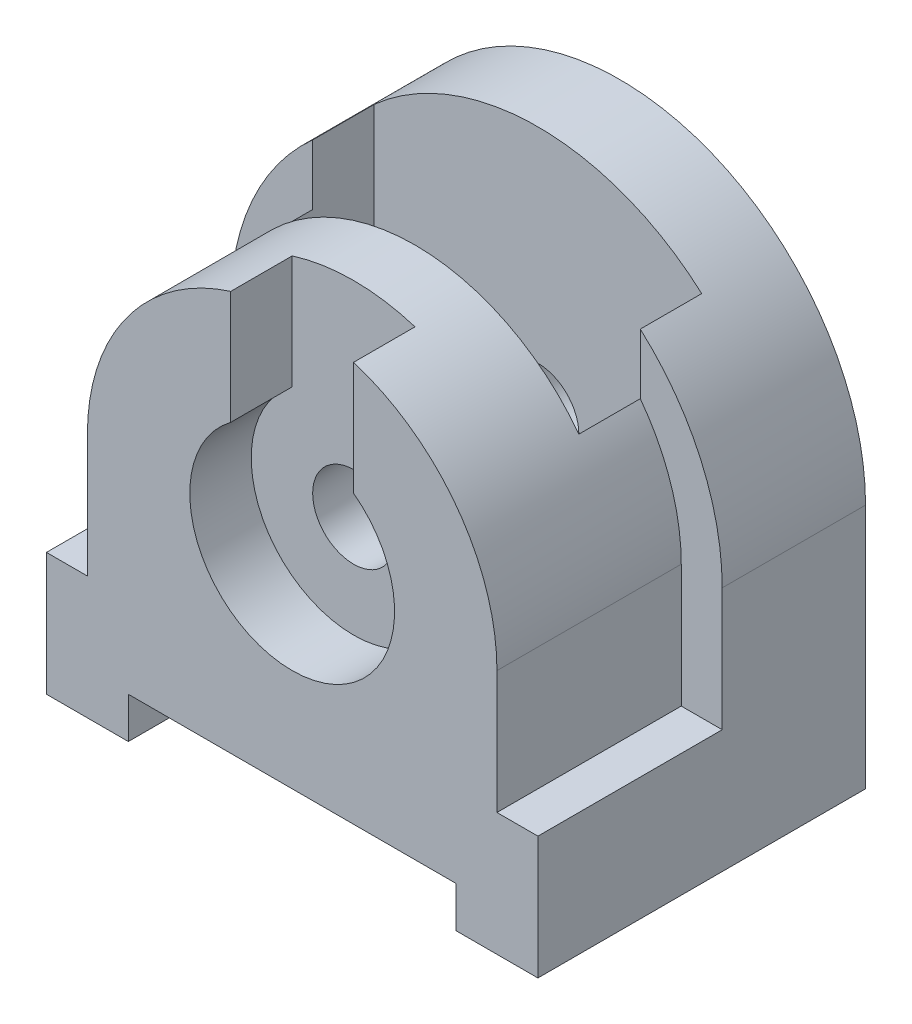
ISO-10303-21;
HEADER;
FILE_DESCRIPTION(('STEP AP214'),'2;1');
FILE_NAME('part.step','',(''),(''),'','','');
FILE_SCHEMA(('AUTOMOTIVE_DESIGN { 1 0 10303 214 1 1 1 1 }'));
ENDSEC;
DATA;
#1=APPLICATION_CONTEXT('core data for automotive mechanical design processes');
#2=APPLICATION_PROTOCOL_DEFINITION('international standard','automotive_design',2000,#1);
#3=PRODUCT_CONTEXT('',#1,'mechanical');
#4=PRODUCT('Part','Part','',(#3));
#5=PRODUCT_RELATED_PRODUCT_CATEGORY('part','',(#4));
#6=PRODUCT_DEFINITION_FORMATION('','',#4);
#7=PRODUCT_DEFINITION_CONTEXT('part definition',#1,'design');
#8=PRODUCT_DEFINITION('design','',#6,#7);
#9=PRODUCT_DEFINITION_SHAPE('','',#8);
#10=(LENGTH_UNIT() NAMED_UNIT(*) SI_UNIT(.MILLI.,.METRE.));
#11=(NAMED_UNIT(*) PLANE_ANGLE_UNIT() SI_UNIT($,.RADIAN.));
#12=(NAMED_UNIT(*) SI_UNIT($,.STERADIAN.) SOLID_ANGLE_UNIT());
#13=UNCERTAINTY_MEASURE_WITH_UNIT(LENGTH_MEASURE(1.E-05),#10,'distance_accuracy_value','');
#14=(GEOMETRIC_REPRESENTATION_CONTEXT(3) GLOBAL_UNCERTAINTY_ASSIGNED_CONTEXT((#13)) GLOBAL_UNIT_ASSIGNED_CONTEXT((#10,
#11,#12)) REPRESENTATION_CONTEXT('',''));
#15=CARTESIAN_POINT('',(0.,0.,0.));
#16=DIRECTION('',(0.,0.,1.));
#17=DIRECTION('',(1.,0.,0.));
#18=AXIS2_PLACEMENT_3D('',#15,#16,#17);
#19=CARTESIAN_POINT('',(100.,960.,20.));
#20=DIRECTION('',(0.,0.,-1.));
#21=DIRECTION('',(-1.,0.,0.));
#22=AXIS2_PLACEMENT_3D('',#19,#20,#21);
#23=PLANE('',#22);
#24=CARTESIAN_POINT('',(60.,60.,20.));
#25=DIRECTION('',(0.,0.,-1.));
#26=DIRECTION('',(-1.,0.,0.));
#27=AXIS2_PLACEMENT_3D('',#24,#25,#26);
#28=CIRCLE('',#27,9.99999999999999);
#29=CARTESIAN_POINT('',(50.,60.,20.));
#30=VERTEX_POINT('',#29);
#31=EDGE_CURVE('E37',#30,#30,#28,.F.);
#32=ORIENTED_EDGE('',*,*,#31,.F.);
#33=EDGE_LOOP('',(#32));
#34=FACE_BOUND('',#33,.T.);
#35=DIRECTION('',(0.,1.,0.));
#36=VECTOR('',#35,1.);
#37=CARTESIAN_POINT('',(65.,10.,20.));
#38=LINE('',#37,#36);
#39=CARTESIAN_POINT('',(65.,10.,20.));
#40=VERTEX_POINT('',#39);
#41=CARTESIAN_POINT('',(65.,35.,20.));
#42=VERTEX_POINT('',#41);
#43=EDGE_CURVE('E516',#40,#42,#38,.T.);
#44=ORIENTED_EDGE('',*,*,#43,.F.);
#45=DIRECTION('',(1.,0.,0.));
#46=VECTOR('',#45,1.);
#47=CARTESIAN_POINT('',(100.,10.,20.));
#48=LINE('',#47,#46);
#49=CARTESIAN_POINT('',(100.,10.,20.));
#50=VERTEX_POINT('',#49);
#51=EDGE_CURVE('E252',#40,#50,#48,.T.);
#52=ORIENTED_EDGE('',*,*,#51,.T.);
#53=DIRECTION('',(0.,-1.,0.));
#54=VECTOR('',#53,1.);
#55=CARTESIAN_POINT('',(100.,960.,20.));
#56=LINE('',#55,#54);
#57=CARTESIAN_POINT('',(100.,104.721359549996,20.));
#58=VERTEX_POINT('',#57);
#59=EDGE_CURVE('E256',#58,#50,#56,.T.);
#60=ORIENTED_EDGE('',*,*,#59,.F.);
#61=CARTESIAN_POINT('',(60.,60.,20.));
#62=DIRECTION('',(0.,0.,-1.));
#63=DIRECTION('',(-1.,0.,0.));
#64=AXIS2_PLACEMENT_3D('',#61,#62,#63);
#65=CIRCLE('',#64,60.);
#66=CARTESIAN_POINT('',(20.,104.721359549996,20.));
#67=VERTEX_POINT('',#66);
#68=EDGE_CURVE('E271',#58,#67,#65,.F.);
#69=ORIENTED_EDGE('',*,*,#68,.T.);
#70=DIRECTION('',(0.,-1.,0.));
#71=VECTOR('',#70,1.);
#72=CARTESIAN_POINT('',(20.,960.,20.));
#73=LINE('',#72,#71);
#74=CARTESIAN_POINT('',(20.,10.,20.));
#75=VERTEX_POINT('',#74);
#76=EDGE_CURVE('E260',#67,#75,#73,.T.);
#77=ORIENTED_EDGE('',*,*,#76,.T.);
#78=CARTESIAN_POINT('',(55.,10.,20.));
#79=VERTEX_POINT('',#78);
#80=EDGE_CURVE('E253',#75,#79,#48,.T.);
#81=ORIENTED_EDGE('',*,*,#80,.T.);
#82=DIRECTION('',(0.,-1.,0.));
#83=VECTOR('',#82,1.);
#84=CARTESIAN_POINT('',(55.,10.,20.));
#85=LINE('',#84,#83);
#86=CARTESIAN_POINT('',(55.,35.,20.));
#87=VERTEX_POINT('',#86);
#88=EDGE_CURVE('E55',#87,#79,#85,.T.);
#89=ORIENTED_EDGE('',*,*,#88,.F.);
#90=DIRECTION('',(-1.,0.,0.));
#91=VECTOR('',#90,1.);
#92=CARTESIAN_POINT('',(65.,35.,20.));
#93=LINE('',#92,#91);
#94=EDGE_CURVE('E50',#42,#87,#93,.T.);
#95=ORIENTED_EDGE('',*,*,#94,.F.);
#96=EDGE_LOOP('',(#44,#52,#60,#69,#77,#81,#89,#95));
#97=FACE_BOUND('',#96,.T.);
#98=ADVANCED_FACE('F33',(#34,#97),#23,.F.);
#99=CARTESIAN_POINT('',(100.,960.,50.));
#100=DIRECTION('',(0.,0.,1.));
#101=DIRECTION('',(1.,0.,0.));
#102=AXIS2_PLACEMENT_3D('',#99,#100,#101);
#103=PLANE('',#102);
#104=CARTESIAN_POINT('',(60.,60.,50.));
#105=DIRECTION('',(0.,0.,1.));
#106=DIRECTION('',(1.,0.,0.));
#107=AXIS2_PLACEMENT_3D('',#104,#105,#106);
#108=CIRCLE('',#107,9.99999999999999);
#109=CARTESIAN_POINT('',(70.,60.,50.));
#110=VERTEX_POINT('',#109);
#111=EDGE_CURVE('E268',#110,#110,#108,.F.);
#112=ORIENTED_EDGE('',*,*,#111,.F.);
#113=EDGE_LOOP('',(#112));
#114=FACE_BOUND('',#113,.T.);
#115=DIRECTION('',(0.,1.,0.));
#116=VECTOR('',#115,1.);
#117=CARTESIAN_POINT('',(65.,10.,50.));
#118=LINE('',#117,#116);
#119=CARTESIAN_POINT('',(65.,10.,50.));
#120=VERTEX_POINT('',#119);
#121=CARTESIAN_POINT('',(65.,35.,50.));
#122=VERTEX_POINT('',#121);
#123=EDGE_CURVE('E508',#120,#122,#118,.T.);
#124=ORIENTED_EDGE('',*,*,#123,.T.);
#125=DIRECTION('',(-1.,0.,0.));
#126=VECTOR('',#125,1.);
#127=CARTESIAN_POINT('',(65.,35.,50.));
#128=LINE('',#127,#126);
#129=CARTESIAN_POINT('',(55.,35.,50.));
#130=VERTEX_POINT('',#129);
#131=EDGE_CURVE('E237',#122,#130,#128,.T.);
#132=ORIENTED_EDGE('',*,*,#131,.T.);
#133=DIRECTION('',(0.,-1.,0.));
#134=VECTOR('',#133,1.);
#135=CARTESIAN_POINT('',(55.,10.,50.));
#136=LINE('',#135,#134);
#137=CARTESIAN_POINT('',(55.,10.,50.));
#138=VERTEX_POINT('',#137);
#139=EDGE_CURVE('E234',#130,#138,#136,.T.);
#140=ORIENTED_EDGE('',*,*,#139,.T.);
#141=DIRECTION('',(-1.,0.,0.));
#142=VECTOR('',#141,1.);
#143=CARTESIAN_POINT('',(100.,10.,50.));
#144=LINE('',#143,#142);
#145=CARTESIAN_POINT('',(20.,10.,50.));
#146=VERTEX_POINT('',#145);
#147=EDGE_CURVE('E219',#138,#146,#144,.T.);
#148=ORIENTED_EDGE('',*,*,#147,.T.);
#149=DIRECTION('',(0.,-1.,0.));
#150=VECTOR('',#149,1.);
#151=CARTESIAN_POINT('',(20.,960.,50.));
#152=LINE('',#151,#150);
#153=CARTESIAN_POINT('',(20.,90.0000000000002,50.));
#154=VERTEX_POINT('',#153);
#155=EDGE_CURVE('E262',#154,#146,#152,.T.);
#156=ORIENTED_EDGE('',*,*,#155,.F.);
#157=CARTESIAN_POINT('',(60.,60.,50.));
#158=DIRECTION('',(0.,0.,-1.));
#159=DIRECTION('',(1.,0.,0.));
#160=AXIS2_PLACEMENT_3D('',#157,#158,#159);
#161=CIRCLE('',#160,50.);
#162=CARTESIAN_POINT('',(100.,90.0000000000002,50.));
#163=VERTEX_POINT('',#162);
#164=EDGE_CURVE('E273',#154,#163,#161,.T.);
#165=ORIENTED_EDGE('',*,*,#164,.T.);
#166=DIRECTION('',(0.,-1.,0.));
#167=VECTOR('',#166,1.);
#168=CARTESIAN_POINT('',(100.,960.,50.));
#169=LINE('',#168,#167);
#170=CARTESIAN_POINT('',(100.,10.,50.));
#171=VERTEX_POINT('',#170);
#172=EDGE_CURVE('E255',#163,#171,#169,.T.);
#173=ORIENTED_EDGE('',*,*,#172,.T.);
#174=EDGE_CURVE('E230',#171,#120,#144,.T.);
#175=ORIENTED_EDGE('',*,*,#174,.T.);
#176=EDGE_LOOP('',(#124,#132,#140,#148,#156,#165,#173,#175));
#177=FACE_BOUND('',#176,.T.);
#178=ADVANCED_FACE('F235',(#114,#177),#103,.F.);
#179=CARTESIAN_POINT('',(60.,60.,0.));
#180=DIRECTION('',(0.,0.,1.));
#181=DIRECTION('',(1.,0.,0.));
#182=AXIS2_PLACEMENT_3D('',#179,#180,#181);
#183=CYLINDRICAL_SURFACE('',#182,9.99999999999999);
#184=ORIENTED_EDGE('',*,*,#31,.T.);
#185=EDGE_LOOP('',(#184));
#186=FACE_BOUND('',#185,.T.);
#187=CARTESIAN_POINT('',(60.,60.,0.));
#188=DIRECTION('',(0.,0.,1.));
#189=DIRECTION('',(1.,0.,0.));
#190=AXIS2_PLACEMENT_3D('',#187,#188,#189);
#191=CIRCLE('',#190,9.99999999999999);
#192=CARTESIAN_POINT('',(70.,60.,0.));
#193=VERTEX_POINT('',#192);
#194=EDGE_CURVE('E370',#193,#193,#191,.T.);
#195=ORIENTED_EDGE('',*,*,#194,.F.);
#196=EDGE_LOOP('',(#195));
#197=FACE_BOUND('',#196,.T.);
#198=ADVANCED_FACE('F448',(#186,#197),#183,.F.);
#199=CARTESIAN_POINT('',(60.,60.,0.));
#200=DIRECTION('',(0.,0.,1.));
#201=DIRECTION('',(1.,0.,0.));
#202=AXIS2_PLACEMENT_3D('',#199,#200,#201);
#203=CYLINDRICAL_SURFACE('',#202,60.);
#204=DIRECTION('',(0.,0.,1.));
#205=VECTOR('',#204,1.);
#206=CARTESIAN_POINT('',(100.,104.721359549996,0.));
#207=LINE('',#206,#205);
#208=CARTESIAN_POINT('',(100.,104.721359549996,35.));
#209=VERTEX_POINT('',#208);
#210=EDGE_CURVE('E266',#209,#58,#207,.F.);
#211=ORIENTED_EDGE('',*,*,#210,.F.);
#212=CARTESIAN_POINT('',(60.,60.,35.));
#213=DIRECTION('',(0.,0.,1.));
#214=DIRECTION('',(1.,0.,0.));
#215=AXIS2_PLACEMENT_3D('',#212,#213,#214);
#216=CIRCLE('',#215,60.);
#217=CARTESIAN_POINT('',(120.,60.,35.));
#218=VERTEX_POINT('',#217);
#219=EDGE_CURVE('E296',#218,#209,#216,.T.);
#220=ORIENTED_EDGE('',*,*,#219,.F.);
#221=DIRECTION('',(0.,0.,-1.));
#222=VECTOR('',#221,1.);
#223=CARTESIAN_POINT('',(120.,60.,80.));
#224=LINE('',#223,#222);
#225=CARTESIAN_POINT('',(120.,60.,0.));
#226=VERTEX_POINT('',#225);
#227=EDGE_CURVE('E425',#218,#226,#224,.T.);
#228=ORIENTED_EDGE('',*,*,#227,.T.);
#229=CARTESIAN_POINT('',(60.,60.,0.));
#230=DIRECTION('',(0.,0.,1.));
#231=DIRECTION('',(1.,0.,0.));
#232=AXIS2_PLACEMENT_3D('',#229,#230,#231);
#233=CIRCLE('',#232,60.);
#234=CARTESIAN_POINT('',(0.,60.,0.));
#235=VERTEX_POINT('',#234);
#236=EDGE_CURVE('E373',#226,#235,#233,.T.);
#237=ORIENTED_EDGE('',*,*,#236,.T.);
#238=DIRECTION('',(0.,0.,-1.));
#239=VECTOR('',#238,1.);
#240=CARTESIAN_POINT('',(0.,60.,80.));
#241=LINE('',#240,#239);
#242=CARTESIAN_POINT('',(0.,60.,35.));
#243=VERTEX_POINT('',#242);
#244=EDGE_CURVE('E415',#243,#235,#241,.T.);
#245=ORIENTED_EDGE('',*,*,#244,.F.);
#246=CARTESIAN_POINT('',(60.,60.,35.));
#247=DIRECTION('',(0.,0.,1.));
#248=DIRECTION('',(1.,0.,0.));
#249=AXIS2_PLACEMENT_3D('',#246,#247,#248);
#250=CIRCLE('',#249,60.);
#251=CARTESIAN_POINT('',(20.,104.721359549996,35.));
#252=VERTEX_POINT('',#251);
#253=EDGE_CURVE('E324',#252,#243,#250,.T.);
#254=ORIENTED_EDGE('',*,*,#253,.F.);
#255=DIRECTION('',(0.,0.,1.));
#256=VECTOR('',#255,1.);
#257=CARTESIAN_POINT('',(20.,104.721359549996,0.));
#258=LINE('',#257,#256);
#259=EDGE_CURVE('E259',#67,#252,#258,.T.);
#260=ORIENTED_EDGE('',*,*,#259,.F.);
#261=ORIENTED_EDGE('',*,*,#68,.F.);
#262=EDGE_LOOP('',(#211,#220,#228,#237,#245,#254,#260,#261));
#263=FACE_BOUND('',#262,.T.);
#264=ADVANCED_FACE('F548',(#263),#203,.T.);
#265=CARTESIAN_POINT('',(0.,0.,80.));
#266=DIRECTION('',(1.,0.,0.));
#267=DIRECTION('',(0.,0.,-1.));
#268=AXIS2_PLACEMENT_3D('',#265,#266,#267);
#269=PLANE('',#268);
#270=DIRECTION('',(0.,0.,1.));
#271=VECTOR('',#270,1.);
#272=CARTESIAN_POINT('',(0.,30.,35.));
#273=LINE('',#272,#271);
#274=CARTESIAN_POINT('',(0.,30.,35.));
#275=VERTEX_POINT('',#274);
#276=CARTESIAN_POINT('',(0.,30.,80.));
#277=VERTEX_POINT('',#276);
#278=EDGE_CURVE('E346',#275,#277,#273,.T.);
#279=ORIENTED_EDGE('',*,*,#278,.F.);
#280=DIRECTION('',(0.,-1.,0.));
#281=VECTOR('',#280,1.);
#282=CARTESIAN_POINT('',(0.,0.,35.));
#283=LINE('',#282,#281);
#284=EDGE_CURVE('E326',#243,#275,#283,.T.);
#285=ORIENTED_EDGE('',*,*,#284,.F.);
#286=ORIENTED_EDGE('',*,*,#244,.T.);
#287=DIRECTION('',(0.,-1.,0.));
#288=VECTOR('',#287,1.);
#289=CARTESIAN_POINT('',(0.,0.,0.));
#290=LINE('',#289,#288);
#291=CARTESIAN_POINT('',(0.,0.,0.));
#292=VERTEX_POINT('',#291);
#293=EDGE_CURVE('E396',#235,#292,#290,.T.);
#294=ORIENTED_EDGE('',*,*,#293,.T.);
#295=DIRECTION('',(0.,0.,-1.));
#296=VECTOR('',#295,1.);
#297=CARTESIAN_POINT('',(0.,0.,80.));
#298=LINE('',#297,#296);
#299=CARTESIAN_POINT('',(0.,0.,80.));
#300=VERTEX_POINT('',#299);
#301=EDGE_CURVE('E11',#300,#292,#298,.T.);
#302=ORIENTED_EDGE('',*,*,#301,.F.);
#303=DIRECTION('',(0.,-1.,0.));
#304=VECTOR('',#303,1.);
#305=CARTESIAN_POINT('',(0.,0.,80.));
#306=LINE('',#305,#304);
#307=EDGE_CURVE('E405',#277,#300,#306,.T.);
#308=ORIENTED_EDGE('',*,*,#307,.F.);
#309=EDGE_LOOP('',(#279,#285,#286,#294,#302,#308));
#310=FACE_BOUND('',#309,.T.);
#311=ADVANCED_FACE('F35',(#310),#269,.F.);
#312=CARTESIAN_POINT('',(0.,0.,80.));
#313=DIRECTION('',(0.,0.,-1.));
#314=DIRECTION('',(-1.,0.,0.));
#315=AXIS2_PLACEMENT_3D('',#312,#313,#314);
#316=PLANE('',#315);
#317=CARTESIAN_POINT('',(60.,60.,80.));
#318=DIRECTION('',(0.,0.,1.));
#319=DIRECTION('',(1.,0.,0.));
#320=AXIS2_PLACEMENT_3D('',#317,#318,#319);
#321=CIRCLE('',#320,50.);
#322=CARTESIAN_POINT('',(110.,60.,80.));
#323=VERTEX_POINT('',#322);
#324=CARTESIAN_POINT('',(75.,107.696960070847,80.));
#325=VERTEX_POINT('',#324);
#326=EDGE_CURVE('E284',#323,#325,#321,.T.);
#327=ORIENTED_EDGE('',*,*,#326,.T.);
#328=DIRECTION('',(0.,1.,0.));
#329=VECTOR('',#328,1.);
#330=CARTESIAN_POINT('',(75.,80.,80.));
#331=LINE('',#330,#329);
#332=CARTESIAN_POINT('',(75.,80.,80.));
#333=VERTEX_POINT('',#332);
#334=EDGE_CURVE('E361',#333,#325,#331,.T.);
#335=ORIENTED_EDGE('',*,*,#334,.F.);
#336=CARTESIAN_POINT('',(60.,60.,80.));
#337=DIRECTION('',(0.,0.,1.));
#338=DIRECTION('',(-1.,0.,0.));
#339=AXIS2_PLACEMENT_3D('',#336,#337,#338);
#340=CIRCLE('',#339,25.);
#341=CARTESIAN_POINT('',(45.,80.,80.));
#342=VERTEX_POINT('',#341);
#343=EDGE_CURVE('E343',#342,#333,#340,.T.);
#344=ORIENTED_EDGE('',*,*,#343,.F.);
#345=DIRECTION('',(0.,-1.,0.));
#346=VECTOR('',#345,1.);
#347=CARTESIAN_POINT('',(45.,80.,80.));
#348=LINE('',#347,#346);
#349=CARTESIAN_POINT('',(45.,107.696960070847,80.));
#350=VERTEX_POINT('',#349);
#351=EDGE_CURVE('E353',#350,#342,#348,.T.);
#352=ORIENTED_EDGE('',*,*,#351,.F.);
#353=CARTESIAN_POINT('',(60.,60.,80.));
#354=DIRECTION('',(0.,0.,1.));
#355=DIRECTION('',(1.,0.,0.));
#356=AXIS2_PLACEMENT_3D('',#353,#354,#355);
#357=CIRCLE('',#356,50.);
#358=CARTESIAN_POINT('',(10.,60.,80.));
#359=VERTEX_POINT('',#358);
#360=EDGE_CURVE('E311',#350,#359,#357,.T.);
#361=ORIENTED_EDGE('',*,*,#360,.T.);
#362=DIRECTION('',(0.,-1.,0.));
#363=VECTOR('',#362,1.);
#364=CARTESIAN_POINT('',(10.,0.,80.));
#365=LINE('',#364,#363);
#366=CARTESIAN_POINT('',(10.,30.,80.));
#367=VERTEX_POINT('',#366);
#368=EDGE_CURVE('E322',#359,#367,#365,.T.);
#369=ORIENTED_EDGE('',*,*,#368,.T.);
#370=DIRECTION('',(-1.,0.,0.));
#371=VECTOR('',#370,1.);
#372=CARTESIAN_POINT('',(0.,30.,80.));
#373=LINE('',#372,#371);
#374=EDGE_CURVE('E336',#367,#277,#373,.T.);
#375=ORIENTED_EDGE('',*,*,#374,.T.);
#376=ORIENTED_EDGE('',*,*,#307,.T.);
#377=DIRECTION('',(1.,0.,0.));
#378=VECTOR('',#377,1.);
#379=CARTESIAN_POINT('',(0.,0.,80.));
#380=LINE('',#379,#378);
#381=CARTESIAN_POINT('',(20.,0.,80.));
#382=VERTEX_POINT('',#381);
#383=EDGE_CURVE('E409',#300,#382,#380,.T.);
#384=ORIENTED_EDGE('',*,*,#383,.T.);
#385=DIRECTION('',(0.,-1.,0.));
#386=VECTOR('',#385,1.);
#387=CARTESIAN_POINT('',(20.,0.,80.));
#388=LINE('',#387,#386);
#389=CARTESIAN_POINT('',(20.,10.,80.));
#390=VERTEX_POINT('',#389);
#391=EDGE_CURVE('E376',#390,#382,#388,.T.);
#392=ORIENTED_EDGE('',*,*,#391,.F.);
#393=DIRECTION('',(-1.,0.,0.));
#394=VECTOR('',#393,1.);
#395=CARTESIAN_POINT('',(20.,10.,80.));
#396=LINE('',#395,#394);
#397=CARTESIAN_POINT('',(100.,10.,80.));
#398=VERTEX_POINT('',#397);
#399=EDGE_CURVE('E381',#398,#390,#396,.T.);
#400=ORIENTED_EDGE('',*,*,#399,.F.);
#401=DIRECTION('',(0.,1.,0.));
#402=VECTOR('',#401,1.);
#403=CARTESIAN_POINT('',(100.,0.,80.));
#404=LINE('',#403,#402);
#405=CARTESIAN_POINT('',(100.,0.,80.));
#406=VERTEX_POINT('',#405);
#407=EDGE_CURVE('E389',#406,#398,#404,.T.);
#408=ORIENTED_EDGE('',*,*,#407,.F.);
#409=CARTESIAN_POINT('',(120.,0.,80.));
#410=VERTEX_POINT('',#409);
#411=EDGE_CURVE('E407',#406,#410,#380,.T.);
#412=ORIENTED_EDGE('',*,*,#411,.T.);
#413=DIRECTION('',(0.,1.,0.));
#414=VECTOR('',#413,1.);
#415=CARTESIAN_POINT('',(120.,0.,80.));
#416=LINE('',#415,#414);
#417=CARTESIAN_POINT('',(120.,30.,80.));
#418=VERTEX_POINT('',#417);
#419=EDGE_CURVE('E412',#410,#418,#416,.T.);
#420=ORIENTED_EDGE('',*,*,#419,.T.);
#421=DIRECTION('',(1.,0.,0.));
#422=VECTOR('',#421,1.);
#423=CARTESIAN_POINT('',(0.,30.,80.));
#424=LINE('',#423,#422);
#425=CARTESIAN_POINT('',(110.,30.,80.));
#426=VERTEX_POINT('',#425);
#427=EDGE_CURVE('E289',#426,#418,#424,.T.);
#428=ORIENTED_EDGE('',*,*,#427,.F.);
#429=DIRECTION('',(0.,-1.,0.));
#430=VECTOR('',#429,1.);
#431=CARTESIAN_POINT('',(110.,0.,80.));
#432=LINE('',#431,#430);
#433=EDGE_CURVE('E304',#323,#426,#432,.T.);
#434=ORIENTED_EDGE('',*,*,#433,.F.);
#435=EDGE_LOOP('',(#327,#335,#344,#352,#361,#369,#375,#376,#384,#392,#400,#408,#412,#420,#428,#434));
#436=FACE_BOUND('',#435,.T.);
#437=ADVANCED_FACE('F535',(#436),#316,.F.);
#438=CARTESIAN_POINT('',(0.,0.,80.));
#439=DIRECTION('',(0.,1.,0.));
#440=DIRECTION('',(0.,0.,1.));
#441=AXIS2_PLACEMENT_3D('',#438,#439,#440);
#442=PLANE('',#441);
#443=DIRECTION('',(1.,0.,0.));
#444=VECTOR('',#443,1.);
#445=CARTESIAN_POINT('',(0.,0.,0.));
#446=LINE('',#445,#444);
#447=CARTESIAN_POINT('',(20.,0.,0.));
#448=VERTEX_POINT('',#447);
#449=EDGE_CURVE('E419',#292,#448,#446,.T.);
#450=ORIENTED_EDGE('',*,*,#449,.T.);
#451=DIRECTION('',(0.,0.,1.));
#452=VECTOR('',#451,1.);
#453=CARTESIAN_POINT('',(20.,0.,0.));
#454=LINE('',#453,#452);
#455=EDGE_CURVE('E387',#448,#382,#454,.T.);
#456=ORIENTED_EDGE('',*,*,#455,.T.);
#457=ORIENTED_EDGE('',*,*,#383,.F.);
#458=ORIENTED_EDGE('',*,*,#301,.T.);
#459=EDGE_LOOP('',(#450,#456,#457,#458));
#460=FACE_BOUND('',#459,.T.);
#461=ADVANCED_FACE('F541',(#460),#442,.F.);
#462=ORIENTED_EDGE('',*,*,#411,.F.);
#463=DIRECTION('',(0.,0.,1.));
#464=VECTOR('',#463,1.);
#465=CARTESIAN_POINT('',(100.,0.,0.));
#466=LINE('',#465,#464);
#467=CARTESIAN_POINT('',(100.,0.,0.));
#468=VERTEX_POINT('',#467);
#469=EDGE_CURVE('E401',#468,#406,#466,.T.);
#470=ORIENTED_EDGE('',*,*,#469,.F.);
#471=CARTESIAN_POINT('',(120.,0.,0.));
#472=VERTEX_POINT('',#471);
#473=EDGE_CURVE('E418',#468,#472,#446,.T.);
#474=ORIENTED_EDGE('',*,*,#473,.T.);
#475=DIRECTION('',(0.,0.,-1.));
#476=VECTOR('',#475,1.);
#477=CARTESIAN_POINT('',(120.,0.,80.));
#478=LINE('',#477,#476);
#479=EDGE_CURVE('E42',#410,#472,#478,.T.);
#480=ORIENTED_EDGE('',*,*,#479,.F.);
#481=EDGE_LOOP('',(#462,#470,#474,#480));
#482=FACE_BOUND('',#481,.T.);
#483=ADVANCED_FACE('F531',(#482),#442,.F.);
#484=CARTESIAN_POINT('',(120.,0.,80.));
#485=DIRECTION('',(-1.,0.,0.));
#486=DIRECTION('',(0.,0.,1.));
#487=AXIS2_PLACEMENT_3D('',#484,#485,#486);
#488=PLANE('',#487);
#489=DIRECTION('',(0.,1.,0.));
#490=VECTOR('',#489,1.);
#491=CARTESIAN_POINT('',(120.,0.,35.));
#492=LINE('',#491,#490);
#493=CARTESIAN_POINT('',(120.,30.,35.));
#494=VERTEX_POINT('',#493);
#495=EDGE_CURVE('E294',#494,#218,#492,.T.);
#496=ORIENTED_EDGE('',*,*,#495,.F.);
#497=DIRECTION('',(0.,0.,1.));
#498=VECTOR('',#497,1.);
#499=CARTESIAN_POINT('',(120.,30.,35.));
#500=LINE('',#499,#498);
#501=EDGE_CURVE('E312',#494,#418,#500,.T.);
#502=ORIENTED_EDGE('',*,*,#501,.T.);
#503=ORIENTED_EDGE('',*,*,#419,.F.);
#504=ORIENTED_EDGE('',*,*,#479,.T.);
#505=DIRECTION('',(0.,1.,0.));
#506=VECTOR('',#505,1.);
#507=CARTESIAN_POINT('',(120.,0.,0.));
#508=LINE('',#507,#506);
#509=EDGE_CURVE('E408',#472,#226,#508,.T.);
#510=ORIENTED_EDGE('',*,*,#509,.T.);
#511=ORIENTED_EDGE('',*,*,#227,.F.);
#512=EDGE_LOOP('',(#496,#502,#503,#504,#510,#511));
#513=FACE_BOUND('',#512,.T.);
#514=ADVANCED_FACE('F554',(#513),#488,.F.);
#515=CARTESIAN_POINT('',(0.,0.,0.));
#516=DIRECTION('',(0.,0.,-1.));
#517=DIRECTION('',(-1.,0.,0.));
#518=AXIS2_PLACEMENT_3D('',#515,#516,#517);
#519=PLANE('',#518);
#520=ORIENTED_EDGE('',*,*,#194,.T.);
#521=EDGE_LOOP('',(#520));
#522=FACE_BOUND('',#521,.T.);
#523=DIRECTION('',(0.,-1.,0.));
#524=VECTOR('',#523,1.);
#525=CARTESIAN_POINT('',(20.,0.,0.));
#526=LINE('',#525,#524);
#527=CARTESIAN_POINT('',(20.,10.,0.));
#528=VERTEX_POINT('',#527);
#529=EDGE_CURVE('E377',#528,#448,#526,.T.);
#530=ORIENTED_EDGE('',*,*,#529,.T.);
#531=ORIENTED_EDGE('',*,*,#449,.F.);
#532=ORIENTED_EDGE('',*,*,#293,.F.);
#533=ORIENTED_EDGE('',*,*,#236,.F.);
#534=ORIENTED_EDGE('',*,*,#509,.F.);
#535=ORIENTED_EDGE('',*,*,#473,.F.);
#536=DIRECTION('',(0.,1.,0.));
#537=VECTOR('',#536,1.);
#538=CARTESIAN_POINT('',(100.,0.,0.));
#539=LINE('',#538,#537);
#540=CARTESIAN_POINT('',(100.,10.,0.));
#541=VERTEX_POINT('',#540);
#542=EDGE_CURVE('E380',#468,#541,#539,.T.);
#543=ORIENTED_EDGE('',*,*,#542,.T.);
#544=DIRECTION('',(-1.,0.,0.));
#545=VECTOR('',#544,1.);
#546=CARTESIAN_POINT('',(20.,10.,0.));
#547=LINE('',#546,#545);
#548=EDGE_CURVE('E384',#541,#528,#547,.T.);
#549=ORIENTED_EDGE('',*,*,#548,.T.);
#550=EDGE_LOOP('',(#530,#531,#532,#533,#534,#535,#543,#549));
#551=FACE_BOUND('',#550,.T.);
#552=ADVANCED_FACE('F525',(#522,#551),#519,.T.);
#553=CARTESIAN_POINT('',(20.,0.,0.));
#554=DIRECTION('',(-1.,0.,0.));
#555=DIRECTION('',(0.,0.,1.));
#556=AXIS2_PLACEMENT_3D('',#553,#554,#555);
#557=PLANE('',#556);
#558=ORIENTED_EDGE('',*,*,#391,.T.);
#559=ORIENTED_EDGE('',*,*,#455,.F.);
#560=ORIENTED_EDGE('',*,*,#529,.F.);
#561=DIRECTION('',(0.,0.,1.));
#562=VECTOR('',#561,1.);
#563=CARTESIAN_POINT('',(20.,10.,0.));
#564=LINE('',#563,#562);
#565=EDGE_CURVE('E393',#528,#75,#564,.T.);
#566=ORIENTED_EDGE('',*,*,#565,.T.);
#567=ORIENTED_EDGE('',*,*,#76,.F.);
#568=ORIENTED_EDGE('',*,*,#259,.T.);
#569=DIRECTION('',(0.,-1.,0.));
#570=VECTOR('',#569,1.);
#571=CARTESIAN_POINT('',(20.,0.,35.));
#572=LINE('',#571,#570);
#573=CARTESIAN_POINT('',(20.,90.,35.));
#574=VERTEX_POINT('',#573);
#575=EDGE_CURVE('E321',#252,#574,#572,.T.);
#576=ORIENTED_EDGE('',*,*,#575,.T.);
#577=DIRECTION('',(0.,0.,1.));
#578=VECTOR('',#577,1.);
#579=CARTESIAN_POINT('',(20.,90.,35.));
#580=LINE('',#579,#578);
#581=EDGE_CURVE('E333',#574,#154,#580,.T.);
#582=ORIENTED_EDGE('',*,*,#581,.T.);
#583=ORIENTED_EDGE('',*,*,#155,.T.);
#584=EDGE_CURVE('E226',#146,#390,#564,.T.);
#585=ORIENTED_EDGE('',*,*,#584,.T.);
#586=EDGE_LOOP('',(#558,#559,#560,#566,#567,#568,#576,#582,#583,#585));
#587=FACE_BOUND('',#586,.T.);
#588=ADVANCED_FACE('F539',(#587),#557,.F.);
#589=CARTESIAN_POINT('',(20.,10.,0.));
#590=DIRECTION('',(0.,1.,0.));
#591=DIRECTION('',(0.,0.,1.));
#592=AXIS2_PLACEMENT_3D('',#589,#590,#591);
#593=PLANE('',#592);
#594=ORIENTED_EDGE('',*,*,#584,.F.);
#595=ORIENTED_EDGE('',*,*,#147,.F.);
#596=DIRECTION('',(0.,0.,-1.));
#597=VECTOR('',#596,1.);
#598=CARTESIAN_POINT('',(55.,10.,50.));
#599=LINE('',#598,#597);
#600=EDGE_CURVE('E224',#138,#79,#599,.T.);
#601=ORIENTED_EDGE('',*,*,#600,.T.);
#602=ORIENTED_EDGE('',*,*,#80,.F.);
#603=ORIENTED_EDGE('',*,*,#565,.F.);
#604=ORIENTED_EDGE('',*,*,#548,.F.);
#605=DIRECTION('',(0.,0.,1.));
#606=VECTOR('',#605,1.);
#607=CARTESIAN_POINT('',(100.,10.,0.));
#608=LINE('',#607,#606);
#609=EDGE_CURVE('E397',#541,#50,#608,.T.);
#610=ORIENTED_EDGE('',*,*,#609,.T.);
#611=ORIENTED_EDGE('',*,*,#51,.F.);
#612=DIRECTION('',(0.,0.,-1.));
#613=VECTOR('',#612,1.);
#614=CARTESIAN_POINT('',(65.,10.,50.));
#615=LINE('',#614,#613);
#616=EDGE_CURVE('E241',#120,#40,#615,.T.);
#617=ORIENTED_EDGE('',*,*,#616,.F.);
#618=ORIENTED_EDGE('',*,*,#174,.F.);
#619=EDGE_CURVE('E400',#171,#398,#608,.T.);
#620=ORIENTED_EDGE('',*,*,#619,.T.);
#621=ORIENTED_EDGE('',*,*,#399,.T.);
#622=EDGE_LOOP('',(#594,#595,#601,#602,#603,#604,#610,#611,#617,#618,#620,#621));
#623=FACE_BOUND('',#622,.T.);
#624=ADVANCED_FACE('F221',(#623),#593,.F.);
#625=CARTESIAN_POINT('',(100.,0.,0.));
#626=DIRECTION('',(1.,0.,0.));
#627=DIRECTION('',(0.,0.,-1.));
#628=AXIS2_PLACEMENT_3D('',#625,#626,#627);
#629=PLANE('',#628);
#630=ORIENTED_EDGE('',*,*,#407,.T.);
#631=ORIENTED_EDGE('',*,*,#619,.F.);
#632=ORIENTED_EDGE('',*,*,#172,.F.);
#633=DIRECTION('',(0.,0.,1.));
#634=VECTOR('',#633,1.);
#635=CARTESIAN_POINT('',(100.,90.,35.));
#636=LINE('',#635,#634);
#637=CARTESIAN_POINT('',(100.,90.,35.));
#638=VERTEX_POINT('',#637);
#639=EDGE_CURVE('E308',#638,#163,#636,.T.);
#640=ORIENTED_EDGE('',*,*,#639,.F.);
#641=DIRECTION('',(0.,-1.,0.));
#642=VECTOR('',#641,1.);
#643=CARTESIAN_POINT('',(100.,0.,35.));
#644=LINE('',#643,#642);
#645=EDGE_CURVE('E299',#209,#638,#644,.T.);
#646=ORIENTED_EDGE('',*,*,#645,.F.);
#647=ORIENTED_EDGE('',*,*,#210,.T.);
#648=ORIENTED_EDGE('',*,*,#59,.T.);
#649=ORIENTED_EDGE('',*,*,#609,.F.);
#650=ORIENTED_EDGE('',*,*,#542,.F.);
#651=ORIENTED_EDGE('',*,*,#469,.T.);
#652=EDGE_LOOP('',(#630,#631,#632,#640,#646,#647,#648,#649,#650,#651));
#653=FACE_BOUND('',#652,.T.);
#654=ADVANCED_FACE('F445',(#653),#629,.F.);
#655=ORIENTED_EDGE('',*,*,#111,.T.);
#656=EDGE_LOOP('',(#655));
#657=FACE_BOUND('',#656,.T.);
#658=CARTESIAN_POINT('',(60.,60.,65.));
#659=DIRECTION('',(0.,0.,-1.));
#660=DIRECTION('',(-1.,0.,0.));
#661=AXIS2_PLACEMENT_3D('',#658,#659,#660);
#662=CIRCLE('',#661,9.99999999999999);
#663=CARTESIAN_POINT('',(50.,60.,65.));
#664=VERTEX_POINT('',#663);
#665=EDGE_CURVE('E368',#664,#664,#662,.F.);
#666=ORIENTED_EDGE('',*,*,#665,.T.);
#667=EDGE_LOOP('',(#666));
#668=FACE_BOUND('',#667,.T.);
#669=ADVANCED_FACE('F431',(#657,#668),#183,.F.);
#670=CARTESIAN_POINT('',(60.,60.,65.));
#671=DIRECTION('',(0.,0.,-1.));
#672=DIRECTION('',(-1.,0.,0.));
#673=AXIS2_PLACEMENT_3D('',#670,#671,#672);
#674=PLANE('',#673);
#675=DIRECTION('',(0.,1.,0.));
#676=VECTOR('',#675,1.);
#677=CARTESIAN_POINT('',(75.,80.,65.));
#678=LINE('',#677,#676);
#679=CARTESIAN_POINT('',(75.,80.,65.));
#680=VERTEX_POINT('',#679);
#681=CARTESIAN_POINT('',(75.,107.696960070847,65.));
#682=VERTEX_POINT('',#681);
#683=EDGE_CURVE('E352',#680,#682,#678,.T.);
#684=ORIENTED_EDGE('',*,*,#683,.T.);
#685=CARTESIAN_POINT('',(60.,60.,65.));
#686=DIRECTION('',(0.,0.,-1.));
#687=DIRECTION('',(-1.,0.,0.));
#688=AXIS2_PLACEMENT_3D('',#685,#686,#687);
#689=CIRCLE('',#688,50.);
#690=CARTESIAN_POINT('',(45.,107.696960070847,65.));
#691=VERTEX_POINT('',#690);
#692=EDGE_CURVE('E278',#682,#691,#689,.F.);
#693=ORIENTED_EDGE('',*,*,#692,.T.);
#694=DIRECTION('',(0.,-1.,0.));
#695=VECTOR('',#694,1.);
#696=CARTESIAN_POINT('',(45.,80.,65.));
#697=LINE('',#696,#695);
#698=CARTESIAN_POINT('',(45.,80.,65.));
#699=VERTEX_POINT('',#698);
#700=EDGE_CURVE('E356',#691,#699,#697,.T.);
#701=ORIENTED_EDGE('',*,*,#700,.T.);
#702=CARTESIAN_POINT('',(60.,60.,65.));
#703=DIRECTION('',(0.,0.,1.));
#704=DIRECTION('',(-1.,0.,0.));
#705=AXIS2_PLACEMENT_3D('',#702,#703,#704);
#706=CIRCLE('',#705,25.);
#707=EDGE_CURVE('E349',#699,#680,#706,.T.);
#708=ORIENTED_EDGE('',*,*,#707,.T.);
#709=EDGE_LOOP('',(#684,#693,#701,#708));
#710=FACE_BOUND('',#709,.T.);
#711=ORIENTED_EDGE('',*,*,#665,.F.);
#712=EDGE_LOOP('',(#711));
#713=FACE_BOUND('',#712,.T.);
#714=ADVANCED_FACE('F433',(#710,#713),#674,.F.);
#715=CARTESIAN_POINT('',(60.,60.,65.));
#716=DIRECTION('',(0.,0.,1.));
#717=DIRECTION('',(1.,0.,0.));
#718=AXIS2_PLACEMENT_3D('',#715,#716,#717);
#719=CYLINDRICAL_SURFACE('',#718,25.);
#720=ORIENTED_EDGE('',*,*,#343,.T.);
#721=DIRECTION('',(0.,0.,1.));
#722=VECTOR('',#721,1.);
#723=CARTESIAN_POINT('',(75.,80.,65.));
#724=LINE('',#723,#722);
#725=EDGE_CURVE('E358',#680,#333,#724,.T.);
#726=ORIENTED_EDGE('',*,*,#725,.F.);
#727=ORIENTED_EDGE('',*,*,#707,.F.);
#728=DIRECTION('',(0.,0.,1.));
#729=VECTOR('',#728,1.);
#730=CARTESIAN_POINT('',(45.,80.,65.));
#731=LINE('',#730,#729);
#732=EDGE_CURVE('E365',#699,#342,#731,.T.);
#733=ORIENTED_EDGE('',*,*,#732,.T.);
#734=EDGE_LOOP('',(#720,#726,#727,#733));
#735=FACE_BOUND('',#734,.T.);
#736=ADVANCED_FACE('F435',(#735),#719,.F.);
#737=CARTESIAN_POINT('',(45.,80.,65.));
#738=DIRECTION('',(-1.,0.,0.));
#739=DIRECTION('',(0.,0.,1.));
#740=AXIS2_PLACEMENT_3D('',#737,#738,#739);
#741=PLANE('',#740);
#742=ORIENTED_EDGE('',*,*,#700,.F.);
#743=DIRECTION('',(0.,0.,1.));
#744=VECTOR('',#743,1.);
#745=CARTESIAN_POINT('',(45.,107.696960070847,50.));
#746=LINE('',#745,#744);
#747=EDGE_CURVE('E281',#691,#350,#746,.T.);
#748=ORIENTED_EDGE('',*,*,#747,.T.);
#749=ORIENTED_EDGE('',*,*,#351,.T.);
#750=ORIENTED_EDGE('',*,*,#732,.F.);
#751=EDGE_LOOP('',(#742,#748,#749,#750));
#752=FACE_BOUND('',#751,.T.);
#753=ADVANCED_FACE('F442',(#752),#741,.F.);
#754=CARTESIAN_POINT('',(75.,80.,65.));
#755=DIRECTION('',(1.,0.,0.));
#756=DIRECTION('',(0.,0.,-1.));
#757=AXIS2_PLACEMENT_3D('',#754,#755,#756);
#758=PLANE('',#757);
#759=ORIENTED_EDGE('',*,*,#334,.T.);
#760=DIRECTION('',(0.,0.,1.));
#761=VECTOR('',#760,1.);
#762=CARTESIAN_POINT('',(75.,107.696960070847,50.));
#763=LINE('',#762,#761);
#764=EDGE_CURVE('E275',#325,#682,#763,.F.);
#765=ORIENTED_EDGE('',*,*,#764,.T.);
#766=ORIENTED_EDGE('',*,*,#683,.F.);
#767=ORIENTED_EDGE('',*,*,#725,.T.);
#768=EDGE_LOOP('',(#759,#765,#766,#767));
#769=FACE_BOUND('',#768,.T.);
#770=ADVANCED_FACE('F489',(#769),#758,.F.);
#771=CARTESIAN_POINT('',(60.,60.,35.));
#772=DIRECTION('',(0.,0.,1.));
#773=DIRECTION('',(1.,0.,0.));
#774=AXIS2_PLACEMENT_3D('',#771,#772,#773);
#775=CYLINDRICAL_SURFACE('',#774,50.);
#776=ORIENTED_EDGE('',*,*,#164,.F.);
#777=ORIENTED_EDGE('',*,*,#581,.F.);
#778=CARTESIAN_POINT('',(60.,60.,35.));
#779=DIRECTION('',(0.,0.,1.));
#780=DIRECTION('',(1.,0.,0.));
#781=AXIS2_PLACEMENT_3D('',#778,#779,#780);
#782=CIRCLE('',#781,50.);
#783=CARTESIAN_POINT('',(10.,60.,35.));
#784=VERTEX_POINT('',#783);
#785=EDGE_CURVE('E318',#574,#784,#782,.T.);
#786=ORIENTED_EDGE('',*,*,#785,.T.);
#787=DIRECTION('',(0.,0.,1.));
#788=VECTOR('',#787,1.);
#789=CARTESIAN_POINT('',(10.,60.,35.));
#790=LINE('',#789,#788);
#791=EDGE_CURVE('E341',#784,#359,#790,.T.);
#792=ORIENTED_EDGE('',*,*,#791,.T.);
#793=ORIENTED_EDGE('',*,*,#360,.F.);
#794=ORIENTED_EDGE('',*,*,#747,.F.);
#795=ORIENTED_EDGE('',*,*,#692,.F.);
#796=ORIENTED_EDGE('',*,*,#764,.F.);
#797=ORIENTED_EDGE('',*,*,#326,.F.);
#798=DIRECTION('',(0.,0.,1.));
#799=VECTOR('',#798,1.);
#800=CARTESIAN_POINT('',(110.,60.,35.));
#801=LINE('',#800,#799);
#802=CARTESIAN_POINT('',(110.,60.,35.));
#803=VERTEX_POINT('',#802);
#804=EDGE_CURVE('E302',#803,#323,#801,.T.);
#805=ORIENTED_EDGE('',*,*,#804,.F.);
#806=CARTESIAN_POINT('',(60.,60.,35.));
#807=DIRECTION('',(0.,0.,1.));
#808=DIRECTION('',(1.,0.,0.));
#809=AXIS2_PLACEMENT_3D('',#806,#807,#808);
#810=CIRCLE('',#809,50.);
#811=EDGE_CURVE('E285',#803,#638,#810,.T.);
#812=ORIENTED_EDGE('',*,*,#811,.T.);
#813=ORIENTED_EDGE('',*,*,#639,.T.);
#814=EDGE_LOOP('',(#776,#777,#786,#792,#793,#794,#795,#796,#797,#805,#812,#813));
#815=FACE_BOUND('',#814,.T.);
#816=ADVANCED_FACE('F484',(#815),#775,.T.);
#817=CARTESIAN_POINT('',(10.,0.,35.));
#818=DIRECTION('',(-1.,0.,0.));
#819=DIRECTION('',(0.,0.,1.));
#820=AXIS2_PLACEMENT_3D('',#817,#818,#819);
#821=PLANE('',#820);
#822=ORIENTED_EDGE('',*,*,#368,.F.);
#823=ORIENTED_EDGE('',*,*,#791,.F.);
#824=DIRECTION('',(0.,-1.,0.));
#825=VECTOR('',#824,1.);
#826=CARTESIAN_POINT('',(10.,0.,35.));
#827=LINE('',#826,#825);
#828=CARTESIAN_POINT('',(10.,30.,35.));
#829=VERTEX_POINT('',#828);
#830=EDGE_CURVE('E331',#784,#829,#827,.T.);
#831=ORIENTED_EDGE('',*,*,#830,.T.);
#832=DIRECTION('',(0.,0.,1.));
#833=VECTOR('',#832,1.);
#834=CARTESIAN_POINT('',(10.,30.,35.));
#835=LINE('',#834,#833);
#836=EDGE_CURVE('E344',#829,#367,#835,.T.);
#837=ORIENTED_EDGE('',*,*,#836,.T.);
#838=EDGE_LOOP('',(#822,#823,#831,#837));
#839=FACE_BOUND('',#838,.T.);
#840=ADVANCED_FACE('F481',(#839),#821,.T.);
#841=CARTESIAN_POINT('',(0.,30.,35.));
#842=DIRECTION('',(0.,1.,0.));
#843=DIRECTION('',(0.,0.,1.));
#844=AXIS2_PLACEMENT_3D('',#841,#842,#843);
#845=PLANE('',#844);
#846=ORIENTED_EDGE('',*,*,#374,.F.);
#847=ORIENTED_EDGE('',*,*,#836,.F.);
#848=DIRECTION('',(-1.,0.,0.));
#849=VECTOR('',#848,1.);
#850=CARTESIAN_POINT('',(0.,30.,35.));
#851=LINE('',#850,#849);
#852=EDGE_CURVE('E329',#829,#275,#851,.T.);
#853=ORIENTED_EDGE('',*,*,#852,.T.);
#854=ORIENTED_EDGE('',*,*,#278,.T.);
#855=EDGE_LOOP('',(#846,#847,#853,#854));
#856=FACE_BOUND('',#855,.T.);
#857=ADVANCED_FACE('F479',(#856),#845,.T.);
#858=CARTESIAN_POINT('',(0.,0.,35.));
#859=DIRECTION('',(0.,0.,1.));
#860=DIRECTION('',(1.,0.,0.));
#861=AXIS2_PLACEMENT_3D('',#858,#859,#860);
#862=PLANE('',#861);
#863=ORIENTED_EDGE('',*,*,#785,.F.);
#864=ORIENTED_EDGE('',*,*,#575,.F.);
#865=ORIENTED_EDGE('',*,*,#253,.T.);
#866=ORIENTED_EDGE('',*,*,#284,.T.);
#867=ORIENTED_EDGE('',*,*,#852,.F.);
#868=ORIENTED_EDGE('',*,*,#830,.F.);
#869=EDGE_LOOP('',(#863,#864,#865,#866,#867,#868));
#870=FACE_BOUND('',#869,.T.);
#871=ADVANCED_FACE('F472',(#870),#862,.T.);
#872=CARTESIAN_POINT('',(0.,30.,35.));
#873=DIRECTION('',(0.,-1.,0.));
#874=DIRECTION('',(0.,0.,-1.));
#875=AXIS2_PLACEMENT_3D('',#872,#873,#874);
#876=PLANE('',#875);
#877=ORIENTED_EDGE('',*,*,#427,.T.);
#878=ORIENTED_EDGE('',*,*,#501,.F.);
#879=DIRECTION('',(1.,0.,0.));
#880=VECTOR('',#879,1.);
#881=CARTESIAN_POINT('',(0.,30.,35.));
#882=LINE('',#881,#880);
#883=CARTESIAN_POINT('',(110.,30.,35.));
#884=VERTEX_POINT('',#883);
#885=EDGE_CURVE('E292',#884,#494,#882,.T.);
#886=ORIENTED_EDGE('',*,*,#885,.F.);
#887=DIRECTION('',(0.,0.,1.));
#888=VECTOR('',#887,1.);
#889=CARTESIAN_POINT('',(110.,30.,35.));
#890=LINE('',#889,#888);
#891=EDGE_CURVE('E315',#884,#426,#890,.T.);
#892=ORIENTED_EDGE('',*,*,#891,.T.);
#893=EDGE_LOOP('',(#877,#878,#886,#892));
#894=FACE_BOUND('',#893,.T.);
#895=ADVANCED_FACE('F469',(#894),#876,.F.);
#896=CARTESIAN_POINT('',(110.,0.,35.));
#897=DIRECTION('',(-1.,0.,0.));
#898=DIRECTION('',(0.,0.,1.));
#899=AXIS2_PLACEMENT_3D('',#896,#897,#898);
#900=PLANE('',#899);
#901=ORIENTED_EDGE('',*,*,#433,.T.);
#902=ORIENTED_EDGE('',*,*,#891,.F.);
#903=DIRECTION('',(0.,-1.,0.));
#904=VECTOR('',#903,1.);
#905=CARTESIAN_POINT('',(110.,0.,35.));
#906=LINE('',#905,#904);
#907=EDGE_CURVE('E288',#803,#884,#906,.T.);
#908=ORIENTED_EDGE('',*,*,#907,.F.);
#909=ORIENTED_EDGE('',*,*,#804,.T.);
#910=EDGE_LOOP('',(#901,#902,#908,#909));
#911=FACE_BOUND('',#910,.T.);
#912=ADVANCED_FACE('F467',(#911),#900,.F.);
#913=CARTESIAN_POINT('',(0.,0.,35.));
#914=DIRECTION('',(0.,0.,1.));
#915=DIRECTION('',(1.,0.,0.));
#916=AXIS2_PLACEMENT_3D('',#913,#914,#915);
#917=PLANE('',#916);
#918=ORIENTED_EDGE('',*,*,#811,.F.);
#919=ORIENTED_EDGE('',*,*,#907,.T.);
#920=ORIENTED_EDGE('',*,*,#885,.T.);
#921=ORIENTED_EDGE('',*,*,#495,.T.);
#922=ORIENTED_EDGE('',*,*,#219,.T.);
#923=ORIENTED_EDGE('',*,*,#645,.T.);
#924=EDGE_LOOP('',(#918,#919,#920,#921,#922,#923));
#925=FACE_BOUND('',#924,.T.);
#926=ADVANCED_FACE('F464',(#925),#917,.T.);
#927=CARTESIAN_POINT('',(65.,10.,50.));
#928=DIRECTION('',(-1.,0.,0.));
#929=DIRECTION('',(0.,0.,1.));
#930=AXIS2_PLACEMENT_3D('',#927,#928,#929);
#931=PLANE('',#930);
#932=ORIENTED_EDGE('',*,*,#43,.T.);
#933=DIRECTION('',(0.,0.,-1.));
#934=VECTOR('',#933,1.);
#935=CARTESIAN_POINT('',(65.,35.,50.));
#936=LINE('',#935,#934);
#937=EDGE_CURVE('E231',#122,#42,#936,.T.);
#938=ORIENTED_EDGE('',*,*,#937,.F.);
#939=ORIENTED_EDGE('',*,*,#123,.F.);
#940=ORIENTED_EDGE('',*,*,#616,.T.);
#941=EDGE_LOOP('',(#932,#938,#939,#940));
#942=FACE_BOUND('',#941,.T.);
#943=ADVANCED_FACE('F461',(#942),#931,.F.);
#944=CARTESIAN_POINT('',(65.,35.,50.));
#945=DIRECTION('',(0.,-1.,0.));
#946=DIRECTION('',(0.,0.,-1.));
#947=AXIS2_PLACEMENT_3D('',#944,#945,#946);
#948=PLANE('',#947);
#949=ORIENTED_EDGE('',*,*,#94,.T.);
#950=DIRECTION('',(0.,0.,-1.));
#951=VECTOR('',#950,1.);
#952=CARTESIAN_POINT('',(55.,35.,50.));
#953=LINE('',#952,#951);
#954=EDGE_CURVE('E244',#130,#87,#953,.T.);
#955=ORIENTED_EDGE('',*,*,#954,.F.);
#956=ORIENTED_EDGE('',*,*,#131,.F.);
#957=ORIENTED_EDGE('',*,*,#937,.T.);
#958=EDGE_LOOP('',(#949,#955,#956,#957));
#959=FACE_BOUND('',#958,.T.);
#960=ADVANCED_FACE('F513',(#959),#948,.F.);
#961=CARTESIAN_POINT('',(55.,10.,50.));
#962=DIRECTION('',(1.,0.,0.));
#963=DIRECTION('',(0.,0.,-1.));
#964=AXIS2_PLACEMENT_3D('',#961,#962,#963);
#965=PLANE('',#964);
#966=ORIENTED_EDGE('',*,*,#88,.T.);
#967=ORIENTED_EDGE('',*,*,#600,.F.);
#968=ORIENTED_EDGE('',*,*,#139,.F.);
#969=ORIENTED_EDGE('',*,*,#954,.T.);
#970=EDGE_LOOP('',(#966,#967,#968,#969));
#971=FACE_BOUND('',#970,.T.);
#972=ADVANCED_FACE('F243',(#971),#965,.F.);
#973=CLOSED_SHELL('',(#98,#178,#198,#264,#311,#437,#461,#483,#514,#552,#588,#624,#654,#669,#714,
#736,#753,#770,#816,#840,#857,#871,#895,#912,#926,#943,#960,#972));
#974=MANIFOLD_SOLID_BREP('B2',#973);
#975=ADVANCED_BREP_SHAPE_REPRESENTATION('',(#18,#974),#14);
#976=SHAPE_DEFINITION_REPRESENTATION(#9,#975);
ENDSEC;
END-ISO-10303-21;
